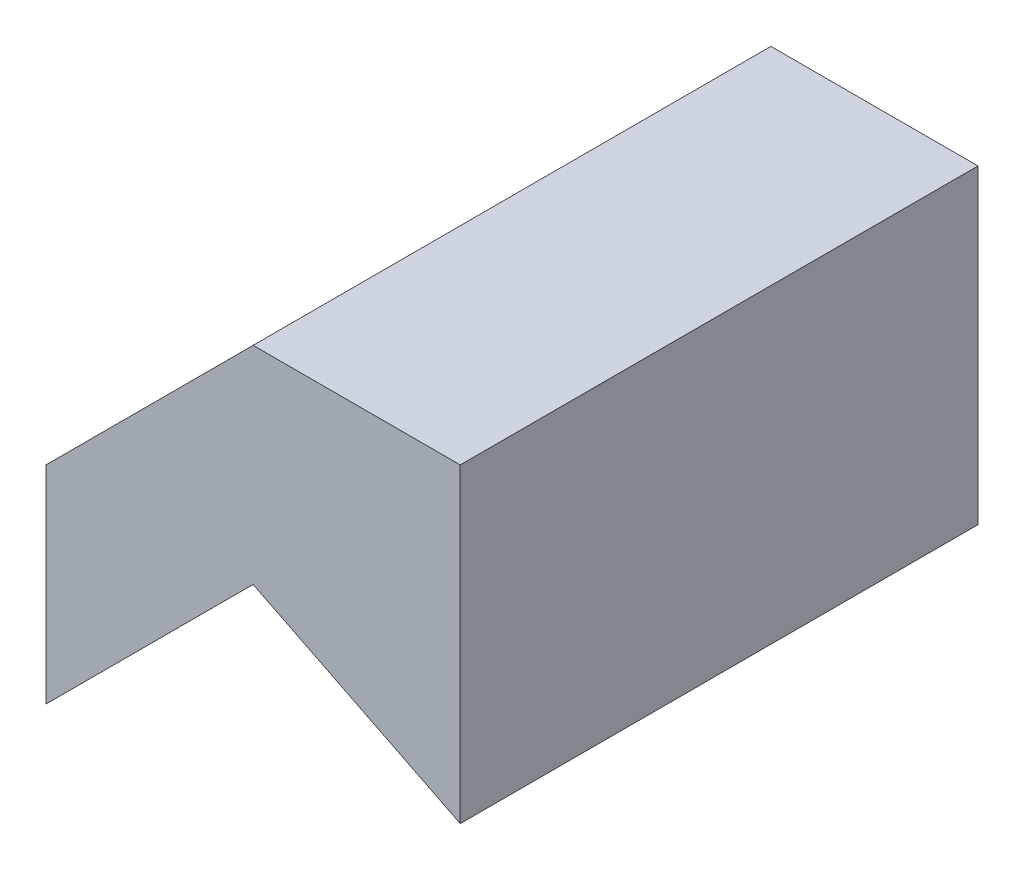
ISO-10303-21;
HEADER;
FILE_DESCRIPTION(('STEP AP214'),'2;1');
FILE_NAME('part.step','',(''),(''),'','','');
FILE_SCHEMA(('AUTOMOTIVE_DESIGN { 1 0 10303 214 1 1 1 1 }'));
ENDSEC;
DATA;
#1=APPLICATION_CONTEXT('core data for automotive mechanical design processes');
#2=APPLICATION_PROTOCOL_DEFINITION('international standard','automotive_design',2000,#1);
#3=PRODUCT_CONTEXT('',#1,'mechanical');
#4=PRODUCT('Part','Part','',(#3));
#5=PRODUCT_RELATED_PRODUCT_CATEGORY('part','',(#4));
#6=PRODUCT_DEFINITION_FORMATION('','',#4);
#7=PRODUCT_DEFINITION_CONTEXT('part definition',#1,'design');
#8=PRODUCT_DEFINITION('design','',#6,#7);
#9=PRODUCT_DEFINITION_SHAPE('','',#8);
#10=(LENGTH_UNIT() NAMED_UNIT(*) SI_UNIT(.MILLI.,.METRE.));
#11=(NAMED_UNIT(*) PLANE_ANGLE_UNIT() SI_UNIT($,.RADIAN.));
#12=(NAMED_UNIT(*) SI_UNIT($,.STERADIAN.) SOLID_ANGLE_UNIT());
#13=UNCERTAINTY_MEASURE_WITH_UNIT(LENGTH_MEASURE(1.E-05),#10,'distance_accuracy_value','');
#14=(GEOMETRIC_REPRESENTATION_CONTEXT(3) GLOBAL_UNCERTAINTY_ASSIGNED_CONTEXT((#13)) GLOBAL_UNIT_ASSIGNED_CONTEXT((#10,
#11,#12)) REPRESENTATION_CONTEXT('',''));
#15=CARTESIAN_POINT('',(0.,0.,0.));
#16=DIRECTION('',(0.,0.,1.));
#17=DIRECTION('',(1.,0.,0.));
#18=AXIS2_PLACEMENT_3D('',#15,#16,#17);
#19=CARTESIAN_POINT('',(-10.,-10.,25.));
#20=DIRECTION('',(1.,0.,0.));
#21=DIRECTION('',(0.,0.,-1.));
#22=AXIS2_PLACEMENT_3D('',#19,#20,#21);
#23=PLANE('',#22);
#24=DIRECTION('',(0.,-1.,0.));
#25=VECTOR('',#24,1.);
#26=CARTESIAN_POINT('',(-10.,-10.,0.));
#27=LINE('',#26,#25);
#28=CARTESIAN_POINT('',(-10.,0.,0.));
#29=VERTEX_POINT('',#28);
#30=CARTESIAN_POINT('',(-10.,-10.,0.));
#31=VERTEX_POINT('',#30);
#32=EDGE_CURVE('E117',#29,#31,#27,.T.);
#33=ORIENTED_EDGE('',*,*,#32,.T.);
#34=DIRECTION('',(0.,0.,-1.));
#35=VECTOR('',#34,1.);
#36=CARTESIAN_POINT('',(-10.,-10.,25.));
#37=LINE('',#36,#35);
#38=CARTESIAN_POINT('',(-10.,-10.,25.));
#39=VERTEX_POINT('',#38);
#40=EDGE_CURVE('E11',#39,#31,#37,.T.);
#41=ORIENTED_EDGE('',*,*,#40,.F.);
#42=DIRECTION('',(0.,-1.,0.));
#43=VECTOR('',#42,1.);
#44=CARTESIAN_POINT('',(-10.,-10.,25.));
#45=LINE('',#44,#43);
#46=CARTESIAN_POINT('',(-10.,0.,25.));
#47=VERTEX_POINT('',#46);
#48=EDGE_CURVE('E127',#47,#39,#45,.T.);
#49=ORIENTED_EDGE('',*,*,#48,.F.);
#50=DIRECTION('',(0.,0.,-1.));
#51=VECTOR('',#50,1.);
#52=CARTESIAN_POINT('',(-10.,0.,25.));
#53=LINE('',#52,#51);
#54=EDGE_CURVE('E113',#47,#29,#53,.T.);
#55=ORIENTED_EDGE('',*,*,#54,.T.);
#56=EDGE_LOOP('',(#33,#41,#49,#55));
#57=FACE_BOUND('',#56,.T.);
#58=ADVANCED_FACE('F33',(#57),#23,.F.);
#59=CARTESIAN_POINT('',(0.,0.,25.));
#60=DIRECTION('',(-0.707106781186547,0.707106781186548,0.));
#61=DIRECTION('',(-0.707106781186548,-0.707106781186547,0.));
#62=AXIS2_PLACEMENT_3D('',#59,#60,#61);
#63=PLANE('',#62);
#64=DIRECTION('',(0.707106781186548,0.707106781186547,0.));
#65=VECTOR('',#64,1.);
#66=CARTESIAN_POINT('',(0.,0.,0.));
#67=LINE('',#66,#65);
#68=CARTESIAN_POINT('',(0.,0.,0.));
#69=VERTEX_POINT('',#68);
#70=EDGE_CURVE('E120',#31,#69,#67,.T.);
#71=ORIENTED_EDGE('',*,*,#70,.T.);
#72=DIRECTION('',(0.,0.,-1.));
#73=VECTOR('',#72,1.);
#74=CARTESIAN_POINT('',(0.,0.,25.));
#75=LINE('',#74,#73);
#76=CARTESIAN_POINT('',(0.,0.,25.));
#77=VERTEX_POINT('',#76);
#78=EDGE_CURVE('E41',#77,#69,#75,.T.);
#79=ORIENTED_EDGE('',*,*,#78,.F.);
#80=DIRECTION('',(0.707106781186548,0.707106781186547,0.));
#81=VECTOR('',#80,1.);
#82=CARTESIAN_POINT('',(0.,0.,25.));
#83=LINE('',#82,#81);
#84=EDGE_CURVE('E86',#39,#77,#83,.T.);
#85=ORIENTED_EDGE('',*,*,#84,.F.);
#86=ORIENTED_EDGE('',*,*,#40,.T.);
#87=EDGE_LOOP('',(#71,#79,#85,#86));
#88=FACE_BOUND('',#87,.T.);
#89=ADVANCED_FACE('F151',(#88),#63,.F.);
#90=CARTESIAN_POINT('',(10.,-5.,25.));
#91=DIRECTION('',(0.447213595499958,0.894427190999916,0.));
#92=DIRECTION('',(-0.894427190999916,0.447213595499958,0.));
#93=AXIS2_PLACEMENT_3D('',#90,#91,#92);
#94=PLANE('',#93);
#95=DIRECTION('',(0.894427190999916,-0.447213595499958,0.));
#96=VECTOR('',#95,1.);
#97=CARTESIAN_POINT('',(10.,-5.,0.));
#98=LINE('',#97,#96);
#99=CARTESIAN_POINT('',(10.,-5.,0.));
#100=VERTEX_POINT('',#99);
#101=EDGE_CURVE('E122',#69,#100,#98,.T.);
#102=ORIENTED_EDGE('',*,*,#101,.T.);
#103=DIRECTION('',(0.,0.,-1.));
#104=VECTOR('',#103,1.);
#105=CARTESIAN_POINT('',(10.,-5.,25.));
#106=LINE('',#105,#104);
#107=CARTESIAN_POINT('',(10.,-5.,25.));
#108=VERTEX_POINT('',#107);
#109=EDGE_CURVE('E108',#108,#100,#106,.T.);
#110=ORIENTED_EDGE('',*,*,#109,.F.);
#111=DIRECTION('',(0.894427190999916,-0.447213595499958,0.));
#112=VECTOR('',#111,1.);
#113=CARTESIAN_POINT('',(10.,-5.,25.));
#114=LINE('',#113,#112);
#115=EDGE_CURVE('E99',#77,#108,#114,.T.);
#116=ORIENTED_EDGE('',*,*,#115,.F.);
#117=ORIENTED_EDGE('',*,*,#78,.T.);
#118=EDGE_LOOP('',(#102,#110,#116,#117));
#119=FACE_BOUND('',#118,.T.);
#120=ADVANCED_FACE('F133',(#119),#94,.F.);
#121=CARTESIAN_POINT('',(10.,10.,25.));
#122=DIRECTION('',(-1.,0.,0.));
#123=DIRECTION('',(0.,-1.,0.));
#124=AXIS2_PLACEMENT_3D('',#121,#122,#123);
#125=PLANE('',#124);
#126=DIRECTION('',(0.,1.,0.));
#127=VECTOR('',#126,1.);
#128=CARTESIAN_POINT('',(10.,10.,0.));
#129=LINE('',#128,#127);
#130=CARTESIAN_POINT('',(10.,10.,0.));
#131=VERTEX_POINT('',#130);
#132=EDGE_CURVE('E107',#100,#131,#129,.T.);
#133=ORIENTED_EDGE('',*,*,#132,.T.);
#134=DIRECTION('',(0.,0.,-1.));
#135=VECTOR('',#134,1.);
#136=CARTESIAN_POINT('',(10.,10.,25.));
#137=LINE('',#136,#135);
#138=CARTESIAN_POINT('',(10.,10.,25.));
#139=VERTEX_POINT('',#138);
#140=EDGE_CURVE('E104',#139,#131,#137,.T.);
#141=ORIENTED_EDGE('',*,*,#140,.F.);
#142=DIRECTION('',(0.,1.,0.));
#143=VECTOR('',#142,1.);
#144=CARTESIAN_POINT('',(10.,10.,25.));
#145=LINE('',#144,#143);
#146=EDGE_CURVE('E93',#108,#139,#145,.T.);
#147=ORIENTED_EDGE('',*,*,#146,.F.);
#148=ORIENTED_EDGE('',*,*,#109,.T.);
#149=EDGE_LOOP('',(#133,#141,#147,#148));
#150=FACE_BOUND('',#149,.T.);
#151=ADVANCED_FACE('F105',(#150),#125,.F.);
#152=CARTESIAN_POINT('',(0.,10.,25.));
#153=DIRECTION('',(0.,-1.,0.));
#154=DIRECTION('',(0.,0.,-1.));
#155=AXIS2_PLACEMENT_3D('',#152,#153,#154);
#156=PLANE('',#155);
#157=DIRECTION('',(-1.,0.,0.));
#158=VECTOR('',#157,1.);
#159=CARTESIAN_POINT('',(0.,10.,0.));
#160=LINE('',#159,#158);
#161=CARTESIAN_POINT('',(0.,10.,0.));
#162=VERTEX_POINT('',#161);
#163=EDGE_CURVE('E72',#131,#162,#160,.T.);
#164=ORIENTED_EDGE('',*,*,#163,.T.);
#165=DIRECTION('',(0.,0.,-1.));
#166=VECTOR('',#165,1.);
#167=CARTESIAN_POINT('',(0.,10.,25.));
#168=LINE('',#167,#166);
#169=CARTESIAN_POINT('',(0.,10.,25.));
#170=VERTEX_POINT('',#169);
#171=EDGE_CURVE('E109',#170,#162,#168,.T.);
#172=ORIENTED_EDGE('',*,*,#171,.F.);
#173=DIRECTION('',(-1.,0.,0.));
#174=VECTOR('',#173,1.);
#175=CARTESIAN_POINT('',(0.,10.,25.));
#176=LINE('',#175,#174);
#177=EDGE_CURVE('E97',#139,#170,#176,.T.);
#178=ORIENTED_EDGE('',*,*,#177,.F.);
#179=ORIENTED_EDGE('',*,*,#140,.T.);
#180=EDGE_LOOP('',(#164,#172,#178,#179));
#181=FACE_BOUND('',#180,.T.);
#182=ADVANCED_FACE('F111',(#181),#156,.F.);
#183=CARTESIAN_POINT('',(-10.,0.,25.));
#184=DIRECTION('',(0.707106781186547,-0.707106781186548,0.));
#185=DIRECTION('',(0.707106781186548,0.707106781186547,0.));
#186=AXIS2_PLACEMENT_3D('',#183,#184,#185);
#187=PLANE('',#186);
#188=DIRECTION('',(-0.707106781186548,-0.707106781186547,0.));
#189=VECTOR('',#188,1.);
#190=CARTESIAN_POINT('',(-10.,0.,0.));
#191=LINE('',#190,#189);
#192=EDGE_CURVE('E78',#162,#29,#191,.T.);
#193=ORIENTED_EDGE('',*,*,#192,.T.);
#194=ORIENTED_EDGE('',*,*,#54,.F.);
#195=DIRECTION('',(-0.707106781186548,-0.707106781186547,0.));
#196=VECTOR('',#195,1.);
#197=CARTESIAN_POINT('',(-10.,0.,25.));
#198=LINE('',#197,#196);
#199=EDGE_CURVE('E49',#170,#47,#198,.T.);
#200=ORIENTED_EDGE('',*,*,#199,.F.);
#201=ORIENTED_EDGE('',*,*,#171,.T.);
#202=EDGE_LOOP('',(#193,#194,#200,#201));
#203=FACE_BOUND('',#202,.T.);
#204=ADVANCED_FACE('F140',(#203),#187,.F.);
#205=CARTESIAN_POINT('',(0.,0.,25.));
#206=DIRECTION('',(0.,0.,-1.));
#207=DIRECTION('',(-1.,0.,0.));
#208=AXIS2_PLACEMENT_3D('',#205,#206,#207);
#209=PLANE('',#208);
#210=ORIENTED_EDGE('',*,*,#48,.T.);
#211=ORIENTED_EDGE('',*,*,#84,.T.);
#212=ORIENTED_EDGE('',*,*,#115,.T.);
#213=ORIENTED_EDGE('',*,*,#146,.T.);
#214=ORIENTED_EDGE('',*,*,#177,.T.);
#215=ORIENTED_EDGE('',*,*,#199,.T.);
#216=EDGE_LOOP('',(#210,#211,#212,#213,#214,#215));
#217=FACE_BOUND('',#216,.T.);
#218=ADVANCED_FACE('F95',(#217),#209,.F.);
#219=CARTESIAN_POINT('',(0.,0.,0.));
#220=DIRECTION('',(0.,0.,-1.));
#221=DIRECTION('',(-1.,0.,0.));
#222=AXIS2_PLACEMENT_3D('',#219,#220,#221);
#223=PLANE('',#222);
#224=ORIENTED_EDGE('',*,*,#32,.F.);
#225=ORIENTED_EDGE('',*,*,#192,.F.);
#226=ORIENTED_EDGE('',*,*,#163,.F.);
#227=ORIENTED_EDGE('',*,*,#132,.F.);
#228=ORIENTED_EDGE('',*,*,#101,.F.);
#229=ORIENTED_EDGE('',*,*,#70,.F.);
#230=EDGE_LOOP('',(#224,#225,#226,#227,#228,#229));
#231=FACE_BOUND('',#230,.T.);
#232=ADVANCED_FACE('F136',(#231),#223,.T.);
#233=CLOSED_SHELL('',(#58,#89,#120,#151,#182,#204,#218,#232));
#234=MANIFOLD_SOLID_BREP('B2',#233);
#235=ADVANCED_BREP_SHAPE_REPRESENTATION('',(#18,#234),#14);
#236=SHAPE_DEFINITION_REPRESENTATION(#9,#235);
ENDSEC;
END-ISO-10303-21;
